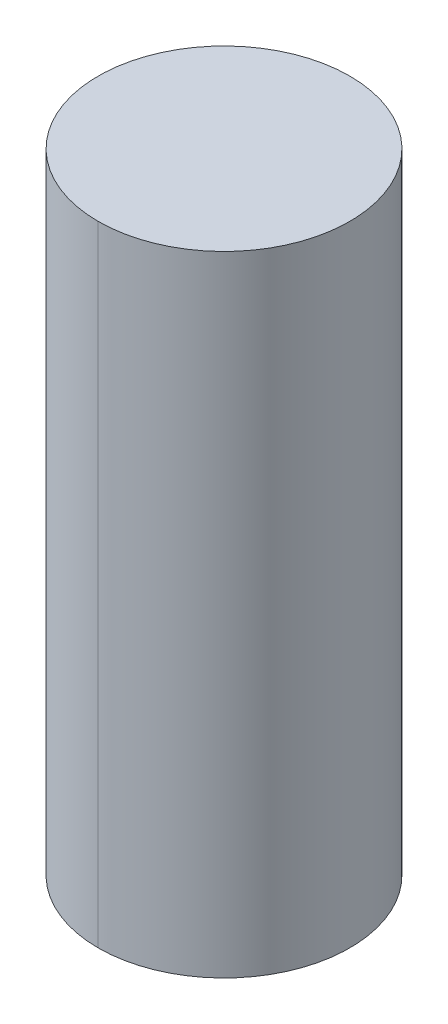
ISO-10303-21;
HEADER;
FILE_DESCRIPTION(('STEP AP214'),'2;1');
FILE_NAME('part.step','',(''),(''),'','','');
FILE_SCHEMA(('AUTOMOTIVE_DESIGN { 1 0 10303 214 1 1 1 1 }'));
ENDSEC;
DATA;
#1=APPLICATION_CONTEXT('core data for automotive mechanical design processes');
#2=APPLICATION_PROTOCOL_DEFINITION('international standard','automotive_design',2000,#1);
#3=PRODUCT_CONTEXT('',#1,'mechanical');
#4=PRODUCT('Part','Part','',(#3));
#5=PRODUCT_RELATED_PRODUCT_CATEGORY('part','',(#4));
#6=PRODUCT_DEFINITION_FORMATION('','',#4);
#7=PRODUCT_DEFINITION_CONTEXT('part definition',#1,'design');
#8=PRODUCT_DEFINITION('design','',#6,#7);
#9=PRODUCT_DEFINITION_SHAPE('','',#8);
#10=(LENGTH_UNIT() NAMED_UNIT(*) SI_UNIT(.MILLI.,.METRE.));
#11=(NAMED_UNIT(*) PLANE_ANGLE_UNIT() SI_UNIT($,.RADIAN.));
#12=(NAMED_UNIT(*) SI_UNIT($,.STERADIAN.) SOLID_ANGLE_UNIT());
#13=UNCERTAINTY_MEASURE_WITH_UNIT(LENGTH_MEASURE(1.E-05),#10,'distance_accuracy_value','');
#14=(GEOMETRIC_REPRESENTATION_CONTEXT(3) GLOBAL_UNCERTAINTY_ASSIGNED_CONTEXT((#13)) GLOBAL_UNIT_ASSIGNED_CONTEXT((#10,
#11,#12)) REPRESENTATION_CONTEXT('',''));
#15=CARTESIAN_POINT('',(0.,0.,0.));
#16=DIRECTION('',(0.,0.,1.));
#17=DIRECTION('',(1.,0.,0.));
#18=AXIS2_PLACEMENT_3D('',#15,#16,#17);
#19=CARTESIAN_POINT('',(0.,13.5,0.));
#20=DIRECTION('',(0.,-1.,0.));
#21=DIRECTION('',(0.,0.,-1.));
#22=AXIS2_PLACEMENT_3D('',#19,#20,#21);
#23=PLANE('',#22);
#24=CARTESIAN_POINT('',(0.,13.5,0.));
#25=DIRECTION('',(0.,-1.,0.));
#26=DIRECTION('',(0.,0.,-1.));
#27=AXIS2_PLACEMENT_3D('',#24,#25,#26);
#28=CIRCLE('',#27,1.);
#29=CARTESIAN_POINT('',(0.,13.5,1.));
#30=VERTEX_POINT('',#29);
#31=CARTESIAN_POINT('',(0.,13.5,-1.));
#32=VERTEX_POINT('',#31);
#33=EDGE_CURVE('E11',#30,#32,#28,.T.);
#34=ORIENTED_EDGE('',*,*,#33,.F.);
#35=CARTESIAN_POINT('',(0.,13.5,0.));
#36=DIRECTION('',(0.,-1.,0.));
#37=DIRECTION('',(0.,0.,-1.));
#38=AXIS2_PLACEMENT_3D('',#35,#36,#37);
#39=CIRCLE('',#38,1.);
#40=EDGE_CURVE('E25',#32,#30,#39,.T.);
#41=ORIENTED_EDGE('',*,*,#40,.F.);
#42=EDGE_LOOP('',(#34,#41));
#43=FACE_BOUND('',#42,.T.);
#44=ADVANCED_FACE('F17',(#43),#23,.F.);
#45=CARTESIAN_POINT('',(0.,8.5,0.));
#46=DIRECTION('',(0.,-1.,0.));
#47=DIRECTION('',(-1.,0.,0.));
#48=AXIS2_PLACEMENT_3D('',#45,#46,#47);
#49=CYLINDRICAL_SURFACE('',#48,1.);
#50=DIRECTION('',(0.,-1.,0.));
#51=VECTOR('',#50,1.);
#52=CARTESIAN_POINT('',(0.,13.5,1.));
#53=LINE('',#52,#51);
#54=CARTESIAN_POINT('',(0.,8.5,1.));
#55=VERTEX_POINT('',#54);
#56=EDGE_CURVE('E45',#30,#55,#53,.T.);
#57=ORIENTED_EDGE('',*,*,#56,.T.);
#58=CARTESIAN_POINT('',(0.,8.5,0.));
#59=DIRECTION('',(0.,-1.,0.));
#60=DIRECTION('',(0.,0.,-1.));
#61=AXIS2_PLACEMENT_3D('',#58,#59,#60);
#62=CIRCLE('',#61,1.);
#63=CARTESIAN_POINT('',(0.,8.5,-1.));
#64=VERTEX_POINT('',#63);
#65=EDGE_CURVE('E41',#64,#55,#62,.T.);
#66=ORIENTED_EDGE('',*,*,#65,.F.);
#67=DIRECTION('',(0.,-1.,0.));
#68=VECTOR('',#67,1.);
#69=CARTESIAN_POINT('',(0.,13.5,-1.));
#70=LINE('',#69,#68);
#71=EDGE_CURVE('E44',#32,#64,#70,.T.);
#72=ORIENTED_EDGE('',*,*,#71,.F.);
#73=ORIENTED_EDGE('',*,*,#40,.T.);
#74=EDGE_LOOP('',(#57,#66,#72,#73));
#75=FACE_BOUND('',#74,.T.);
#76=ADVANCED_FACE('F43',(#75),#49,.T.);
#77=CARTESIAN_POINT('',(0.,8.5,0.));
#78=DIRECTION('',(0.,-1.,0.));
#79=DIRECTION('',(1.,0.,0.));
#80=AXIS2_PLACEMENT_3D('',#77,#78,#79);
#81=CYLINDRICAL_SURFACE('',#80,1.);
#82=ORIENTED_EDGE('',*,*,#56,.F.);
#83=ORIENTED_EDGE('',*,*,#33,.T.);
#84=ORIENTED_EDGE('',*,*,#71,.T.);
#85=CARTESIAN_POINT('',(0.,8.5,0.));
#86=DIRECTION('',(0.,-1.,0.));
#87=DIRECTION('',(0.,0.,-1.));
#88=AXIS2_PLACEMENT_3D('',#85,#86,#87);
#89=CIRCLE('',#88,1.);
#90=EDGE_CURVE('E52',#55,#64,#89,.T.);
#91=ORIENTED_EDGE('',*,*,#90,.F.);
#92=EDGE_LOOP('',(#82,#83,#84,#91));
#93=FACE_BOUND('',#92,.T.);
#94=ADVANCED_FACE('F51',(#93),#81,.T.);
#95=CARTESIAN_POINT('',(0.,8.5,-1.));
#96=DIRECTION('',(0.,1.,0.));
#97=DIRECTION('',(0.,0.,1.));
#98=AXIS2_PLACEMENT_3D('',#95,#96,#97);
#99=PLANE('',#98);
#100=ORIENTED_EDGE('',*,*,#65,.T.);
#101=ORIENTED_EDGE('',*,*,#90,.T.);
#102=EDGE_LOOP('',(#100,#101));
#103=FACE_BOUND('',#102,.T.);
#104=ADVANCED_FACE('F54',(#103),#99,.F.);
#105=CLOSED_SHELL('',(#44,#76,#94,#104));
#106=MANIFOLD_SOLID_BREP('B1',#105);
#107=ADVANCED_BREP_SHAPE_REPRESENTATION('',(#18,#106),#14);
#108=SHAPE_DEFINITION_REPRESENTATION(#9,#107);
ENDSEC;
END-ISO-10303-21;
